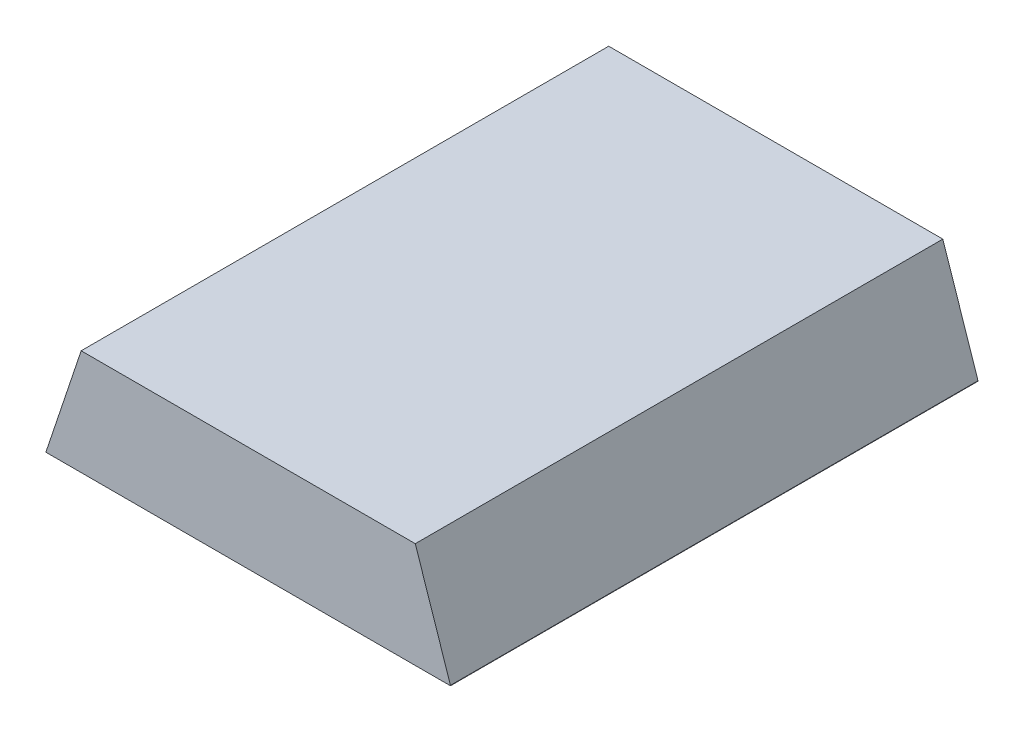
ISO-10303-21;
HEADER;
FILE_DESCRIPTION(('STEP AP214'),'2;1');
FILE_NAME('part.step','',(''),(''),'','','');
FILE_SCHEMA(('AUTOMOTIVE_DESIGN { 1 0 10303 214 1 1 1 1 }'));
ENDSEC;
DATA;
#1=APPLICATION_CONTEXT('core data for automotive mechanical design processes');
#2=APPLICATION_PROTOCOL_DEFINITION('international standard','automotive_design',2000,#1);
#3=PRODUCT_CONTEXT('',#1,'mechanical');
#4=PRODUCT('Part','Part','',(#3));
#5=PRODUCT_RELATED_PRODUCT_CATEGORY('part','',(#4));
#6=PRODUCT_DEFINITION_FORMATION('','',#4);
#7=PRODUCT_DEFINITION_CONTEXT('part definition',#1,'design');
#8=PRODUCT_DEFINITION('design','',#6,#7);
#9=PRODUCT_DEFINITION_SHAPE('','',#8);
#10=(LENGTH_UNIT() NAMED_UNIT(*) SI_UNIT(.MILLI.,.METRE.));
#11=(NAMED_UNIT(*) PLANE_ANGLE_UNIT() SI_UNIT($,.RADIAN.));
#12=(NAMED_UNIT(*) SI_UNIT($,.STERADIAN.) SOLID_ANGLE_UNIT());
#13=UNCERTAINTY_MEASURE_WITH_UNIT(LENGTH_MEASURE(1.E-05),#10,'distance_accuracy_value','');
#14=(GEOMETRIC_REPRESENTATION_CONTEXT(3) GLOBAL_UNCERTAINTY_ASSIGNED_CONTEXT((#13)) GLOBAL_UNIT_ASSIGNED_CONTEXT((#10,
#11,#12)) REPRESENTATION_CONTEXT('',''));
#15=CARTESIAN_POINT('',(0.,0.,0.));
#16=DIRECTION('',(0.,0.,1.));
#17=DIRECTION('',(1.,0.,0.));
#18=AXIS2_PLACEMENT_3D('',#15,#16,#17);
#19=CARTESIAN_POINT('',(0.575,0.3,-0.75));
#20=DIRECTION('',(-1.,0.,0.));
#21=DIRECTION('',(0.,0.,1.));
#22=AXIS2_PLACEMENT_3D('',#19,#20,#21);
#23=PLANE('',#22);
#24=DIRECTION('',(0.,-1.,0.));
#25=VECTOR('',#24,1.);
#26=CARTESIAN_POINT('',(0.575,0.3,-0.75));
#27=LINE('',#26,#25);
#28=CARTESIAN_POINT('',(0.575,0.00113150372571069,-0.75));
#29=VERTEX_POINT('',#28);
#30=CARTESIAN_POINT('',(0.575,0.,-0.75));
#31=VERTEX_POINT('',#30);
#32=EDGE_CURVE('E95',#29,#31,#27,.T.);
#33=ORIENTED_EDGE('',*,*,#32,.F.);
#34=DIRECTION('',(0.,0.,1.));
#35=VECTOR('',#34,1.);
#36=CARTESIAN_POINT('',(0.575,0.00113150372571067,0.75));
#37=LINE('',#36,#35);
#38=CARTESIAN_POINT('',(0.575,0.00113150372571069,0.75));
#39=VERTEX_POINT('',#38);
#40=EDGE_CURVE('E54',#29,#39,#37,.T.);
#41=ORIENTED_EDGE('',*,*,#40,.T.);
#42=DIRECTION('',(0.,-1.,0.));
#43=VECTOR('',#42,1.);
#44=CARTESIAN_POINT('',(0.575,0.3,0.75));
#45=LINE('',#44,#43);
#46=CARTESIAN_POINT('',(0.575,0.,0.75));
#47=VERTEX_POINT('',#46);
#48=EDGE_CURVE('E115',#39,#47,#45,.T.);
#49=ORIENTED_EDGE('',*,*,#48,.T.);
#50=DIRECTION('',(0.,0.,-1.));
#51=VECTOR('',#50,1.);
#52=CARTESIAN_POINT('',(0.575,0.,-0.75));
#53=LINE('',#52,#51);
#54=EDGE_CURVE('E110',#47,#31,#53,.T.);
#55=ORIENTED_EDGE('',*,*,#54,.T.);
#56=EDGE_LOOP('',(#33,#41,#49,#55));
#57=FACE_BOUND('',#56,.T.);
#58=ADVANCED_FACE('F44',(#57),#23,.F.);
#59=CARTESIAN_POINT('',(-0.575,0.3,-0.75));
#60=DIRECTION('',(0.,0.,1.));
#61=DIRECTION('',(1.,0.,0.));
#62=AXIS2_PLACEMENT_3D('',#59,#60,#61);
#63=PLANE('',#62);
#64=DIRECTION('',(-1.,0.,0.));
#65=VECTOR('',#64,1.);
#66=CARTESIAN_POINT('',(-0.575,0.3,-0.75));
#67=LINE('',#66,#65);
#68=CARTESIAN_POINT('',(0.475,0.3,-0.75));
#69=VERTEX_POINT('',#68);
#70=CARTESIAN_POINT('',(-0.475,0.3,-0.75));
#71=VERTEX_POINT('',#70);
#72=EDGE_CURVE('E128',#69,#71,#67,.T.);
#73=ORIENTED_EDGE('',*,*,#72,.F.);
#74=DIRECTION('',(0.317304656405093,-0.948323655206199,0.));
#75=VECTOR('',#74,1.);
#76=CARTESIAN_POINT('',(0.475,0.3,-0.75));
#77=LINE('',#76,#75);
#78=EDGE_CURVE('E68',#69,#29,#77,.T.);
#79=ORIENTED_EDGE('',*,*,#78,.T.);
#80=ORIENTED_EDGE('',*,*,#32,.T.);
#81=DIRECTION('',(-1.,0.,0.));
#82=VECTOR('',#81,1.);
#83=CARTESIAN_POINT('',(-0.575,0.,-0.75));
#84=LINE('',#83,#82);
#85=CARTESIAN_POINT('',(-0.575,0.,-0.75));
#86=VERTEX_POINT('',#85);
#87=EDGE_CURVE('E99',#31,#86,#84,.T.);
#88=ORIENTED_EDGE('',*,*,#87,.T.);
#89=DIRECTION('',(0.,-1.,0.));
#90=VECTOR('',#89,1.);
#91=CARTESIAN_POINT('',(-0.575,0.3,-0.75));
#92=LINE('',#91,#90);
#93=CARTESIAN_POINT('',(-0.575,0.00113150372571069,-0.75));
#94=VERTEX_POINT('',#93);
#95=EDGE_CURVE('E104',#94,#86,#92,.T.);
#96=ORIENTED_EDGE('',*,*,#95,.F.);
#97=DIRECTION('',(0.317304656405093,0.948323655206199,0.));
#98=VECTOR('',#97,1.);
#99=CARTESIAN_POINT('',(-0.475,0.3,-0.75));
#100=LINE('',#99,#98);
#101=EDGE_CURVE('E145',#94,#71,#100,.T.);
#102=ORIENTED_EDGE('',*,*,#101,.T.);
#103=EDGE_LOOP('',(#73,#79,#80,#88,#96,#102));
#104=FACE_BOUND('',#103,.T.);
#105=ADVANCED_FACE('F97',(#104),#63,.F.);
#106=CARTESIAN_POINT('',(-0.575,0.3,-0.75));
#107=DIRECTION('',(1.,0.,0.));
#108=DIRECTION('',(0.,0.,-1.));
#109=AXIS2_PLACEMENT_3D('',#106,#107,#108);
#110=PLANE('',#109);
#111=DIRECTION('',(0.,-1.,0.));
#112=VECTOR('',#111,1.);
#113=CARTESIAN_POINT('',(-0.575,0.3,0.75));
#114=LINE('',#113,#112);
#115=CARTESIAN_POINT('',(-0.575,0.00113150372571069,0.75));
#116=VERTEX_POINT('',#115);
#117=CARTESIAN_POINT('',(-0.575,0.,0.75));
#118=VERTEX_POINT('',#117);
#119=EDGE_CURVE('E131',#116,#118,#114,.T.);
#120=ORIENTED_EDGE('',*,*,#119,.F.);
#121=DIRECTION('',(0.,0.,-1.));
#122=VECTOR('',#121,1.);
#123=CARTESIAN_POINT('',(-0.575,0.00113150372571067,-0.75));
#124=LINE('',#123,#122);
#125=EDGE_CURVE('E142',#116,#94,#124,.T.);
#126=ORIENTED_EDGE('',*,*,#125,.T.);
#127=ORIENTED_EDGE('',*,*,#95,.T.);
#128=DIRECTION('',(0.,0.,1.));
#129=VECTOR('',#128,1.);
#130=CARTESIAN_POINT('',(-0.575,0.,-0.75));
#131=LINE('',#130,#129);
#132=EDGE_CURVE('E112',#86,#118,#131,.T.);
#133=ORIENTED_EDGE('',*,*,#132,.T.);
#134=EDGE_LOOP('',(#120,#126,#127,#133));
#135=FACE_BOUND('',#134,.T.);
#136=ADVANCED_FACE('F171',(#135),#110,.F.);
#137=CARTESIAN_POINT('',(-0.575,0.3,0.75));
#138=DIRECTION('',(0.,0.,-1.));
#139=DIRECTION('',(-1.,0.,0.));
#140=AXIS2_PLACEMENT_3D('',#137,#138,#139);
#141=PLANE('',#140);
#142=ORIENTED_EDGE('',*,*,#48,.F.);
#143=DIRECTION('',(-0.317304656405093,0.948323655206199,0.));
#144=VECTOR('',#143,1.);
#145=CARTESIAN_POINT('',(0.475,0.3,0.75));
#146=LINE('',#145,#144);
#147=CARTESIAN_POINT('',(0.475,0.3,0.75));
#148=VERTEX_POINT('',#147);
#149=EDGE_CURVE('E11',#39,#148,#146,.T.);
#150=ORIENTED_EDGE('',*,*,#149,.T.);
#151=DIRECTION('',(1.,0.,0.));
#152=VECTOR('',#151,1.);
#153=CARTESIAN_POINT('',(-0.575,0.3,0.75));
#154=LINE('',#153,#152);
#155=CARTESIAN_POINT('',(-0.475,0.3,0.75));
#156=VERTEX_POINT('',#155);
#157=EDGE_CURVE('E120',#156,#148,#154,.T.);
#158=ORIENTED_EDGE('',*,*,#157,.F.);
#159=DIRECTION('',(-0.317304656405093,-0.948323655206199,0.));
#160=VECTOR('',#159,1.);
#161=CARTESIAN_POINT('',(-0.475,0.3,0.75));
#162=LINE('',#161,#160);
#163=EDGE_CURVE('E139',#156,#116,#162,.T.);
#164=ORIENTED_EDGE('',*,*,#163,.T.);
#165=ORIENTED_EDGE('',*,*,#119,.T.);
#166=DIRECTION('',(1.,0.,0.));
#167=VECTOR('',#166,1.);
#168=CARTESIAN_POINT('',(-0.575,0.,0.75));
#169=LINE('',#168,#167);
#170=EDGE_CURVE('E125',#118,#47,#169,.T.);
#171=ORIENTED_EDGE('',*,*,#170,.T.);
#172=EDGE_LOOP('',(#142,#150,#158,#164,#165,#171));
#173=FACE_BOUND('',#172,.T.);
#174=ADVANCED_FACE('F169',(#173),#141,.F.);
#175=CARTESIAN_POINT('',(0.,0.3,0.));
#176=DIRECTION('',(0.,1.,0.));
#177=DIRECTION('',(0.,0.,1.));
#178=AXIS2_PLACEMENT_3D('',#175,#176,#177);
#179=PLANE('',#178);
#180=ORIENTED_EDGE('',*,*,#157,.T.);
#181=DIRECTION('',(0.,0.,-1.));
#182=VECTOR('',#181,1.);
#183=CARTESIAN_POINT('',(0.475,0.3,-0.75));
#184=LINE('',#183,#182);
#185=EDGE_CURVE('E149',#148,#69,#184,.T.);
#186=ORIENTED_EDGE('',*,*,#185,.T.);
#187=ORIENTED_EDGE('',*,*,#72,.T.);
#188=DIRECTION('',(0.,0.,1.));
#189=VECTOR('',#188,1.);
#190=CARTESIAN_POINT('',(-0.475,0.3,0.75));
#191=LINE('',#190,#189);
#192=EDGE_CURVE('E103',#71,#156,#191,.T.);
#193=ORIENTED_EDGE('',*,*,#192,.T.);
#194=EDGE_LOOP('',(#180,#186,#187,#193));
#195=FACE_BOUND('',#194,.T.);
#196=ADVANCED_FACE('F159',(#195),#179,.T.);
#197=CARTESIAN_POINT('',(0.,0.,0.));
#198=DIRECTION('',(0.,1.,0.));
#199=DIRECTION('',(0.,0.,1.));
#200=AXIS2_PLACEMENT_3D('',#197,#198,#199);
#201=PLANE('',#200);
#202=ORIENTED_EDGE('',*,*,#54,.F.);
#203=ORIENTED_EDGE('',*,*,#170,.F.);
#204=ORIENTED_EDGE('',*,*,#132,.F.);
#205=ORIENTED_EDGE('',*,*,#87,.F.);
#206=EDGE_LOOP('',(#202,#203,#204,#205));
#207=FACE_BOUND('',#206,.T.);
#208=ADVANCED_FACE('F108',(#207),#201,.F.);
#209=CARTESIAN_POINT('',(-0.475,0.3,0.));
#210=DIRECTION('',(-0.948323655206199,0.317304656405093,0.));
#211=DIRECTION('',(0.,0.,-1.));
#212=AXIS2_PLACEMENT_3D('',#209,#210,#211);
#213=PLANE('',#212);
#214=ORIENTED_EDGE('',*,*,#101,.F.);
#215=ORIENTED_EDGE('',*,*,#125,.F.);
#216=ORIENTED_EDGE('',*,*,#163,.F.);
#217=ORIENTED_EDGE('',*,*,#192,.F.);
#218=EDGE_LOOP('',(#214,#215,#216,#217));
#219=FACE_BOUND('',#218,.T.);
#220=ADVANCED_FACE('F166',(#219),#213,.T.);
#221=CARTESIAN_POINT('',(0.475,0.3,0.));
#222=DIRECTION('',(0.948323655206199,0.317304656405093,0.));
#223=DIRECTION('',(0.,0.,1.));
#224=AXIS2_PLACEMENT_3D('',#221,#222,#223);
#225=PLANE('',#224);
#226=ORIENTED_EDGE('',*,*,#149,.F.);
#227=ORIENTED_EDGE('',*,*,#40,.F.);
#228=ORIENTED_EDGE('',*,*,#78,.F.);
#229=ORIENTED_EDGE('',*,*,#185,.F.);
#230=EDGE_LOOP('',(#226,#227,#228,#229));
#231=FACE_BOUND('',#230,.T.);
#232=ADVANCED_FACE('F47',(#231),#225,.T.);
#233=CLOSED_SHELL('',(#58,#105,#136,#174,#196,#208,#220,#232));
#234=MANIFOLD_SOLID_BREP('B2',#233);
#235=ADVANCED_BREP_SHAPE_REPRESENTATION('',(#18,#234),#14);
#236=SHAPE_DEFINITION_REPRESENTATION(#9,#235);
ENDSEC;
END-ISO-10303-21;
